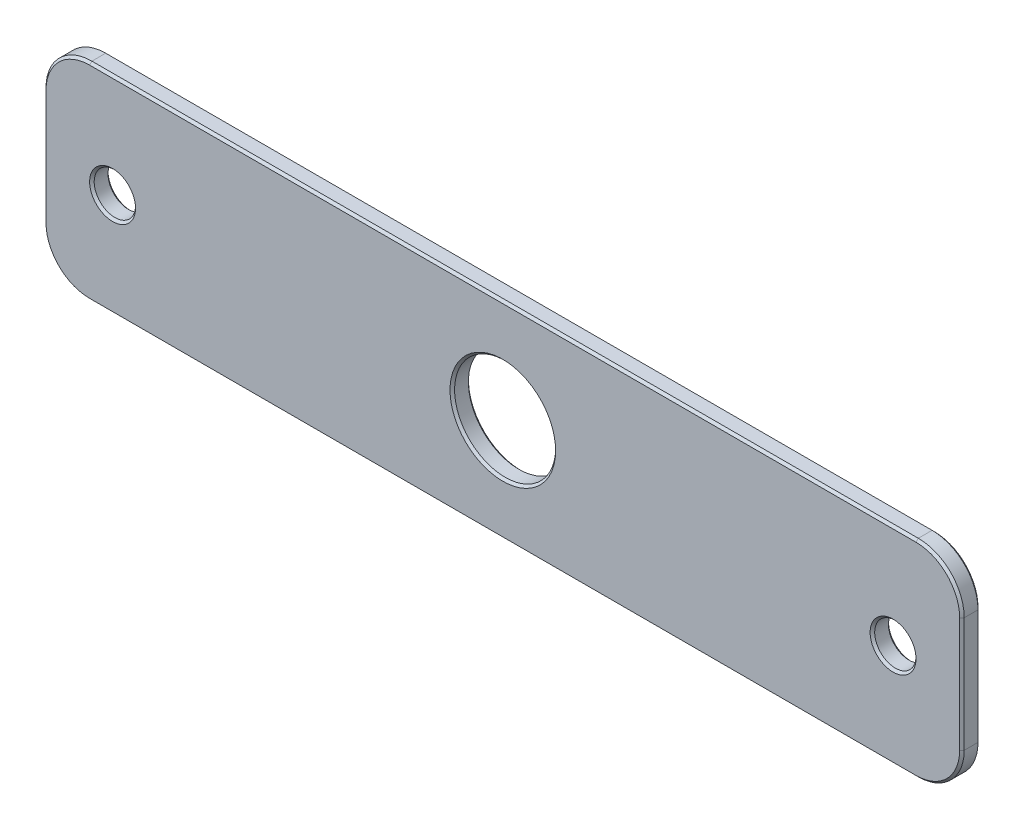
ISO-10303-21;
HEADER;
FILE_DESCRIPTION(('STEP AP214'),'2;1');
FILE_NAME('part.step','',(''),(''),'','','');
FILE_SCHEMA(('AUTOMOTIVE_DESIGN { 1 0 10303 214 1 1 1 1 }'));
ENDSEC;
DATA;
#1=APPLICATION_CONTEXT('core data for automotive mechanical design processes');
#2=APPLICATION_PROTOCOL_DEFINITION('international standard','automotive_design',2000,#1);
#3=PRODUCT_CONTEXT('',#1,'mechanical');
#4=PRODUCT('Part','Part','',(#3));
#5=PRODUCT_RELATED_PRODUCT_CATEGORY('part','',(#4));
#6=PRODUCT_DEFINITION_FORMATION('','',#4);
#7=PRODUCT_DEFINITION_CONTEXT('part definition',#1,'design');
#8=PRODUCT_DEFINITION('design','',#6,#7);
#9=PRODUCT_DEFINITION_SHAPE('','',#8);
#10=(LENGTH_UNIT() NAMED_UNIT(*) SI_UNIT(.MILLI.,.METRE.));
#11=(NAMED_UNIT(*) PLANE_ANGLE_UNIT() SI_UNIT($,.RADIAN.));
#12=(NAMED_UNIT(*) SI_UNIT($,.STERADIAN.) SOLID_ANGLE_UNIT());
#13=UNCERTAINTY_MEASURE_WITH_UNIT(LENGTH_MEASURE(1.E-05),#10,'distance_accuracy_value','');
#14=(GEOMETRIC_REPRESENTATION_CONTEXT(3) GLOBAL_UNCERTAINTY_ASSIGNED_CONTEXT((#13)) GLOBAL_UNIT_ASSIGNED_CONTEXT((#10,
#11,#12)) REPRESENTATION_CONTEXT('',''));
#15=CARTESIAN_POINT('',(0.,0.,0.));
#16=DIRECTION('',(0.,0.,1.));
#17=DIRECTION('',(1.,0.,0.));
#18=AXIS2_PLACEMENT_3D('',#15,#16,#17);
#19=CARTESIAN_POINT('',(-121.919003271456,81.5789473684211,4.));
#20=DIRECTION('',(1.,0.,0.));
#21=DIRECTION('',(0.,1.,0.));
#22=AXIS2_PLACEMENT_3D('',#19,#20,#21);
#23=PLANE('',#22);
#24=DIRECTION('',(0.,0.,-1.));
#25=VECTOR('',#24,1.);
#26=CARTESIAN_POINT('',(-121.919003271456,46.5789473684211,4.));
#27=LINE('',#26,#25);
#28=CARTESIAN_POINT('',(-121.919003271456,46.5789473684211,0.5));
#29=VERTEX_POINT('',#28);
#30=CARTESIAN_POINT('',(-121.919003271456,46.5789473684211,3.5));
#31=VERTEX_POINT('',#30);
#32=EDGE_CURVE('E179',#29,#31,#27,.F.);
#33=ORIENTED_EDGE('',*,*,#32,.T.);
#34=DIRECTION('',(0.,1.,0.));
#35=VECTOR('',#34,1.);
#36=CARTESIAN_POINT('',(-121.919003271456,71.5789473684211,3.49999999999997));
#37=LINE('',#36,#35);
#38=CARTESIAN_POINT('',(-121.919003271456,71.5789473684211,3.5));
#39=VERTEX_POINT('',#38);
#40=EDGE_CURVE('E304',#31,#39,#37,.T.);
#41=ORIENTED_EDGE('',*,*,#40,.T.);
#42=DIRECTION('',(0.,0.,-1.));
#43=VECTOR('',#42,1.);
#44=CARTESIAN_POINT('',(-121.919003271456,71.5789473684211,4.));
#45=LINE('',#44,#43);
#46=CARTESIAN_POINT('',(-121.919003271456,71.5789473684211,0.5));
#47=VERTEX_POINT('',#46);
#48=EDGE_CURVE('E380',#39,#47,#45,.T.);
#49=ORIENTED_EDGE('',*,*,#48,.T.);
#50=DIRECTION('',(0.,-1.,0.));
#51=VECTOR('',#50,1.);
#52=CARTESIAN_POINT('',(-121.919003271456,81.5789473684211,0.5));
#53=LINE('',#52,#51);
#54=EDGE_CURVE('E311',#47,#29,#53,.T.);
#55=ORIENTED_EDGE('',*,*,#54,.T.);
#56=EDGE_LOOP('',(#33,#41,#49,#55));
#57=FACE_BOUND('',#56,.T.);
#58=ADVANCED_FACE('F35',(#57),#23,.F.);
#59=CARTESIAN_POINT('',(-121.919003271456,36.5789473684211,4.));
#60=DIRECTION('',(0.,1.,0.));
#61=DIRECTION('',(0.,0.,1.));
#62=AXIS2_PLACEMENT_3D('',#59,#60,#61);
#63=PLANE('',#62);
#64=DIRECTION('',(0.,0.,-1.));
#65=VECTOR('',#64,1.);
#66=CARTESIAN_POINT('',(68.0809967285443,36.5789473684211,4.));
#67=LINE('',#66,#65);
#68=CARTESIAN_POINT('',(68.0809967285443,36.5789473684211,0.5));
#69=VERTEX_POINT('',#68);
#70=CARTESIAN_POINT('',(68.0809967285443,36.5789473684211,3.5));
#71=VERTEX_POINT('',#70);
#72=EDGE_CURVE('E355',#69,#71,#67,.F.);
#73=ORIENTED_EDGE('',*,*,#72,.T.);
#74=DIRECTION('',(-1.,0.,0.));
#75=VECTOR('',#74,1.);
#76=CARTESIAN_POINT('',(-111.919003271456,36.5789473684211,3.5));
#77=LINE('',#76,#75);
#78=CARTESIAN_POINT('',(-111.919003271456,36.5789473684211,3.5));
#79=VERTEX_POINT('',#78);
#80=EDGE_CURVE('E213',#71,#79,#77,.T.);
#81=ORIENTED_EDGE('',*,*,#80,.T.);
#82=DIRECTION('',(0.,0.,-1.));
#83=VECTOR('',#82,1.);
#84=CARTESIAN_POINT('',(-111.919003271456,36.5789473684211,4.));
#85=LINE('',#84,#83);
#86=CARTESIAN_POINT('',(-111.919003271456,36.5789473684211,0.5));
#87=VERTEX_POINT('',#86);
#88=EDGE_CURVE('E352',#79,#87,#85,.T.);
#89=ORIENTED_EDGE('',*,*,#88,.T.);
#90=DIRECTION('',(1.,0.,0.));
#91=VECTOR('',#90,1.);
#92=CARTESIAN_POINT('',(-121.919003271456,36.5789473684211,0.5));
#93=LINE('',#92,#91);
#94=EDGE_CURVE('E58',#87,#69,#93,.T.);
#95=ORIENTED_EDGE('',*,*,#94,.T.);
#96=EDGE_LOOP('',(#73,#81,#89,#95));
#97=FACE_BOUND('',#96,.T.);
#98=ADVANCED_FACE('F385',(#97),#63,.F.);
#99=CARTESIAN_POINT('',(78.0809967285443,81.5789473684211,4.));
#100=DIRECTION('',(-1.,0.,0.));
#101=DIRECTION('',(0.,-1.,0.));
#102=AXIS2_PLACEMENT_3D('',#99,#100,#101);
#103=PLANE('',#102);
#104=DIRECTION('',(0.,0.,-1.));
#105=VECTOR('',#104,1.);
#106=CARTESIAN_POINT('',(78.0809967285443,71.5789473684211,4.));
#107=LINE('',#106,#105);
#108=CARTESIAN_POINT('',(78.0809967285443,71.5789473684211,0.5));
#109=VERTEX_POINT('',#108);
#110=CARTESIAN_POINT('',(78.0809967285443,71.5789473684211,3.5));
#111=VERTEX_POINT('',#110);
#112=EDGE_CURVE('E348',#109,#111,#107,.F.);
#113=ORIENTED_EDGE('',*,*,#112,.T.);
#114=DIRECTION('',(0.,-1.,0.));
#115=VECTOR('',#114,1.);
#116=CARTESIAN_POINT('',(78.0809967285443,46.5789473684211,3.5));
#117=LINE('',#116,#115);
#118=CARTESIAN_POINT('',(78.0809967285443,46.5789473684211,3.5));
#119=VERTEX_POINT('',#118);
#120=EDGE_CURVE('E314',#111,#119,#117,.T.);
#121=ORIENTED_EDGE('',*,*,#120,.T.);
#122=DIRECTION('',(0.,0.,-1.));
#123=VECTOR('',#122,1.);
#124=CARTESIAN_POINT('',(78.0809967285443,46.5789473684211,4.));
#125=LINE('',#124,#123);
#126=CARTESIAN_POINT('',(78.0809967285443,46.5789473684211,0.5));
#127=VERTEX_POINT('',#126);
#128=EDGE_CURVE('E173',#119,#127,#125,.T.);
#129=ORIENTED_EDGE('',*,*,#128,.T.);
#130=DIRECTION('',(0.,1.,0.));
#131=VECTOR('',#130,1.);
#132=CARTESIAN_POINT('',(78.0809967285443,81.5789473684211,0.5));
#133=LINE('',#132,#131);
#134=EDGE_CURVE('E310',#127,#109,#133,.T.);
#135=ORIENTED_EDGE('',*,*,#134,.T.);
#136=EDGE_LOOP('',(#113,#121,#129,#135));
#137=FACE_BOUND('',#136,.T.);
#138=ADVANCED_FACE('F347',(#137),#103,.F.);
#139=CARTESIAN_POINT('',(-121.919003271456,81.5789473684211,4.));
#140=DIRECTION('',(0.,-1.,0.));
#141=DIRECTION('',(0.,0.,-1.));
#142=AXIS2_PLACEMENT_3D('',#139,#140,#141);
#143=PLANE('',#142);
#144=DIRECTION('',(0.,0.,-1.));
#145=VECTOR('',#144,1.);
#146=CARTESIAN_POINT('',(-111.919003271456,81.5789473684211,4.));
#147=LINE('',#146,#145);
#148=CARTESIAN_POINT('',(-111.919003271456,81.5789473684211,0.5));
#149=VERTEX_POINT('',#148);
#150=CARTESIAN_POINT('',(-111.919003271456,81.5789473684211,3.5));
#151=VERTEX_POINT('',#150);
#152=EDGE_CURVE('E377',#149,#151,#147,.F.);
#153=ORIENTED_EDGE('',*,*,#152,.T.);
#154=DIRECTION('',(1.,0.,0.));
#155=VECTOR('',#154,1.);
#156=CARTESIAN_POINT('',(68.0809967285443,81.5789473684211,3.5));
#157=LINE('',#156,#155);
#158=CARTESIAN_POINT('',(68.0809967285443,81.5789473684211,3.5));
#159=VERTEX_POINT('',#158);
#160=EDGE_CURVE('E316',#151,#159,#157,.T.);
#161=ORIENTED_EDGE('',*,*,#160,.T.);
#162=DIRECTION('',(0.,0.,-1.));
#163=VECTOR('',#162,1.);
#164=CARTESIAN_POINT('',(68.0809967285443,81.5789473684211,4.));
#165=LINE('',#164,#163);
#166=CARTESIAN_POINT('',(68.0809967285443,81.5789473684211,0.5));
#167=VERTEX_POINT('',#166);
#168=EDGE_CURVE('E375',#159,#167,#165,.T.);
#169=ORIENTED_EDGE('',*,*,#168,.T.);
#170=DIRECTION('',(-1.,0.,0.));
#171=VECTOR('',#170,1.);
#172=CARTESIAN_POINT('',(-121.919003271456,81.5789473684211,0.5));
#173=LINE('',#172,#171);
#174=EDGE_CURVE('E369',#167,#149,#173,.T.);
#175=ORIENTED_EDGE('',*,*,#174,.T.);
#176=EDGE_LOOP('',(#153,#161,#169,#175));
#177=FACE_BOUND('',#176,.T.);
#178=ADVANCED_FACE('F374',(#177),#143,.F.);
#179=CARTESIAN_POINT('',(0.,0.,4.));
#180=DIRECTION('',(0.,0.,1.));
#181=DIRECTION('',(1.,0.,0.));
#182=AXIS2_PLACEMENT_3D('',#179,#180,#181);
#183=PLANE('',#182);
#184=CARTESIAN_POINT('',(-106.919003271456,59.0789473684211,4.));
#185=DIRECTION('',(0.,0.,1.));
#186=DIRECTION('',(1.,0.,0.));
#187=AXIS2_PLACEMENT_3D('',#184,#185,#186);
#188=CIRCLE('',#187,5.);
#189=CARTESIAN_POINT('',(-101.919003271456,59.0789473684211,4.));
#190=VERTEX_POINT('',#189);
#191=EDGE_CURVE('E222',#190,#190,#188,.F.);
#192=ORIENTED_EDGE('',*,*,#191,.T.);
#193=EDGE_LOOP('',(#192));
#194=FACE_BOUND('',#193,.T.);
#195=CARTESIAN_POINT('',(-21.9190032714557,59.0789473684211,4.));
#196=DIRECTION('',(0.,0.,1.));
#197=DIRECTION('',(1.,0.,0.));
#198=AXIS2_PLACEMENT_3D('',#195,#196,#197);
#199=CIRCLE('',#198,11.5);
#200=CARTESIAN_POINT('',(-10.4190032714556,59.0789473684211,4.));
#201=VERTEX_POINT('',#200);
#202=EDGE_CURVE('E219',#201,#201,#199,.F.);
#203=ORIENTED_EDGE('',*,*,#202,.T.);
#204=EDGE_LOOP('',(#203));
#205=FACE_BOUND('',#204,.T.);
#206=CARTESIAN_POINT('',(63.0809967285443,59.0789473684211,4.));
#207=DIRECTION('',(0.,0.,1.));
#208=DIRECTION('',(1.,0.,0.));
#209=AXIS2_PLACEMENT_3D('',#206,#207,#208);
#210=CIRCLE('',#209,5.);
#211=CARTESIAN_POINT('',(68.0809967285443,59.0789473684211,4.));
#212=VERTEX_POINT('',#211);
#213=EDGE_CURVE('E216',#212,#212,#210,.F.);
#214=ORIENTED_EDGE('',*,*,#213,.T.);
#215=EDGE_LOOP('',(#214));
#216=FACE_BOUND('',#215,.T.);
#217=CARTESIAN_POINT('',(68.0809967285443,71.5789473684211,4.));
#218=DIRECTION('',(0.,0.,1.));
#219=DIRECTION('',(1.,0.,0.));
#220=AXIS2_PLACEMENT_3D('',#217,#218,#219);
#221=CIRCLE('',#220,9.49999999999999);
#222=CARTESIAN_POINT('',(77.5809967285443,71.5789473684211,4.));
#223=VERTEX_POINT('',#222);
#224=CARTESIAN_POINT('',(68.0809967285443,81.0789473684211,4.));
#225=VERTEX_POINT('',#224);
#226=EDGE_CURVE('E362',#223,#225,#221,.T.);
#227=ORIENTED_EDGE('',*,*,#226,.T.);
#228=DIRECTION('',(-1.,0.,0.));
#229=VECTOR('',#228,1.);
#230=CARTESIAN_POINT('',(-111.919003271456,81.0789473684211,4.));
#231=LINE('',#230,#229);
#232=CARTESIAN_POINT('',(-111.919003271456,81.0789473684211,4.));
#233=VERTEX_POINT('',#232);
#234=EDGE_CURVE('E366',#225,#233,#231,.T.);
#235=ORIENTED_EDGE('',*,*,#234,.T.);
#236=CARTESIAN_POINT('',(-111.919003271456,71.5789473684211,4.));
#237=DIRECTION('',(0.,0.,1.));
#238=DIRECTION('',(1.,0.,0.));
#239=AXIS2_PLACEMENT_3D('',#236,#237,#238);
#240=CIRCLE('',#239,9.49999999999999);
#241=CARTESIAN_POINT('',(-121.419003271456,71.5789473684211,4.));
#242=VERTEX_POINT('',#241);
#243=EDGE_CURVE('E364',#233,#242,#240,.T.);
#244=ORIENTED_EDGE('',*,*,#243,.T.);
#245=DIRECTION('',(0.,-1.,0.));
#246=VECTOR('',#245,1.);
#247=CARTESIAN_POINT('',(-121.419003271456,46.5789473684211,4.));
#248=LINE('',#247,#246);
#249=CARTESIAN_POINT('',(-121.419003271456,46.5789473684211,4.));
#250=VERTEX_POINT('',#249);
#251=EDGE_CURVE('E156',#242,#250,#248,.T.);
#252=ORIENTED_EDGE('',*,*,#251,.T.);
#253=CARTESIAN_POINT('',(-111.919003271456,46.5789473684211,4.));
#254=DIRECTION('',(0.,0.,1.));
#255=DIRECTION('',(1.,0.,0.));
#256=AXIS2_PLACEMENT_3D('',#253,#254,#255);
#257=CIRCLE('',#256,9.49999999999999);
#258=CARTESIAN_POINT('',(-111.919003271456,37.0789473684211,4.));
#259=VERTEX_POINT('',#258);
#260=EDGE_CURVE('E150',#250,#259,#257,.T.);
#261=ORIENTED_EDGE('',*,*,#260,.T.);
#262=DIRECTION('',(1.,0.,0.));
#263=VECTOR('',#262,1.);
#264=CARTESIAN_POINT('',(68.0809967285443,37.0789473684211,4.));
#265=LINE('',#264,#263);
#266=CARTESIAN_POINT('',(68.0809967285443,37.0789473684211,4.));
#267=VERTEX_POINT('',#266);
#268=EDGE_CURVE('E153',#259,#267,#265,.T.);
#269=ORIENTED_EDGE('',*,*,#268,.T.);
#270=CARTESIAN_POINT('',(68.0809967285443,46.5789473684211,4.));
#271=DIRECTION('',(0.,0.,1.));
#272=DIRECTION('',(1.,0.,0.));
#273=AXIS2_PLACEMENT_3D('',#270,#271,#272);
#274=CIRCLE('',#273,9.49999999999999);
#275=CARTESIAN_POINT('',(77.5809967285443,46.5789473684211,4.));
#276=VERTEX_POINT('',#275);
#277=EDGE_CURVE('E162',#267,#276,#274,.T.);
#278=ORIENTED_EDGE('',*,*,#277,.T.);
#279=DIRECTION('',(0.,1.,0.));
#280=VECTOR('',#279,1.);
#281=CARTESIAN_POINT('',(77.5809967285443,71.5789473684211,4.));
#282=LINE('',#281,#280);
#283=EDGE_CURVE('E161',#276,#223,#282,.T.);
#284=ORIENTED_EDGE('',*,*,#283,.T.);
#285=EDGE_LOOP('',(#227,#235,#244,#252,#261,#269,#278,#284));
#286=FACE_BOUND('',#285,.T.);
#287=ADVANCED_FACE('F152',(#194,#205,#216,#286),#183,.T.);
#288=CARTESIAN_POINT('',(0.,0.,0.));
#289=DIRECTION('',(0.,0.,1.));
#290=DIRECTION('',(1.,0.,0.));
#291=AXIS2_PLACEMENT_3D('',#288,#289,#290);
#292=PLANE('',#291);
#293=CARTESIAN_POINT('',(-106.919003271456,59.0789473684211,0.));
#294=DIRECTION('',(0.,0.,1.));
#295=DIRECTION('',(1.,0.,0.));
#296=AXIS2_PLACEMENT_3D('',#293,#294,#295);
#297=CIRCLE('',#296,4.99999999999998);
#298=CARTESIAN_POINT('',(-101.919003271456,59.0789473684211,0.));
#299=VERTEX_POINT('',#298);
#300=EDGE_CURVE('E231',#299,#299,#297,.T.);
#301=ORIENTED_EDGE('',*,*,#300,.T.);
#302=EDGE_LOOP('',(#301));
#303=FACE_BOUND('',#302,.T.);
#304=CARTESIAN_POINT('',(-21.9190032714557,59.0789473684211,0.));
#305=DIRECTION('',(0.,0.,1.));
#306=DIRECTION('',(1.,0.,0.));
#307=AXIS2_PLACEMENT_3D('',#304,#305,#306);
#308=CIRCLE('',#307,11.5);
#309=CARTESIAN_POINT('',(-10.4190032714557,59.0789473684211,0.));
#310=VERTEX_POINT('',#309);
#311=EDGE_CURVE('E228',#310,#310,#308,.T.);
#312=ORIENTED_EDGE('',*,*,#311,.T.);
#313=EDGE_LOOP('',(#312));
#314=FACE_BOUND('',#313,.T.);
#315=CARTESIAN_POINT('',(63.0809967285443,59.0789473684211,0.));
#316=DIRECTION('',(0.,0.,1.));
#317=DIRECTION('',(1.,0.,0.));
#318=AXIS2_PLACEMENT_3D('',#315,#316,#317);
#319=CIRCLE('',#318,4.99999999999998);
#320=CARTESIAN_POINT('',(68.0809967285443,59.0789473684211,0.));
#321=VERTEX_POINT('',#320);
#322=EDGE_CURVE('E225',#321,#321,#319,.T.);
#323=ORIENTED_EDGE('',*,*,#322,.T.);
#324=EDGE_LOOP('',(#323));
#325=FACE_BOUND('',#324,.T.);
#326=CARTESIAN_POINT('',(-111.919003271456,71.5789473684211,0.));
#327=DIRECTION('',(0.,0.,1.));
#328=DIRECTION('',(1.,0.,0.));
#329=AXIS2_PLACEMENT_3D('',#326,#327,#328);
#330=CIRCLE('',#329,9.49999999999999);
#331=CARTESIAN_POINT('',(-121.419003271456,71.5789473684211,0.));
#332=VERTEX_POINT('',#331);
#333=CARTESIAN_POINT('',(-111.919003271456,81.0789473684211,0.));
#334=VERTEX_POINT('',#333);
#335=EDGE_CURVE('E256',#332,#334,#330,.F.);
#336=ORIENTED_EDGE('',*,*,#335,.T.);
#337=DIRECTION('',(1.,0.,0.));
#338=VECTOR('',#337,1.);
#339=CARTESIAN_POINT('',(0.,81.0789473684211,0.));
#340=LINE('',#339,#338);
#341=CARTESIAN_POINT('',(68.0809967285443,81.0789473684211,0.));
#342=VERTEX_POINT('',#341);
#343=EDGE_CURVE('E259',#334,#342,#340,.T.);
#344=ORIENTED_EDGE('',*,*,#343,.T.);
#345=CARTESIAN_POINT('',(68.0809967285443,71.5789473684211,0.));
#346=DIRECTION('',(0.,0.,1.));
#347=DIRECTION('',(1.,0.,0.));
#348=AXIS2_PLACEMENT_3D('',#345,#346,#347);
#349=CIRCLE('',#348,9.49999999999999);
#350=CARTESIAN_POINT('',(77.5809967285443,71.5789473684211,0.));
#351=VERTEX_POINT('',#350);
#352=EDGE_CURVE('E265',#342,#351,#349,.F.);
#353=ORIENTED_EDGE('',*,*,#352,.T.);
#354=DIRECTION('',(0.,-1.,0.));
#355=VECTOR('',#354,1.);
#356=CARTESIAN_POINT('',(77.5809967285443,0.,0.));
#357=LINE('',#356,#355);
#358=CARTESIAN_POINT('',(77.5809967285443,46.5789473684211,0.));
#359=VERTEX_POINT('',#358);
#360=EDGE_CURVE('E328',#351,#359,#357,.T.);
#361=ORIENTED_EDGE('',*,*,#360,.T.);
#362=CARTESIAN_POINT('',(68.0809967285443,46.5789473684211,0.));
#363=DIRECTION('',(0.,0.,1.));
#364=DIRECTION('',(1.,0.,0.));
#365=AXIS2_PLACEMENT_3D('',#362,#363,#364);
#366=CIRCLE('',#365,9.5);
#367=CARTESIAN_POINT('',(68.0809967285443,37.0789473684211,0.));
#368=VERTEX_POINT('',#367);
#369=EDGE_CURVE('E323',#359,#368,#366,.F.);
#370=ORIENTED_EDGE('',*,*,#369,.T.);
#371=DIRECTION('',(-1.,0.,0.));
#372=VECTOR('',#371,1.);
#373=CARTESIAN_POINT('',(0.,37.0789473684211,0.));
#374=LINE('',#373,#372);
#375=CARTESIAN_POINT('',(-111.919003271456,37.0789473684211,0.));
#376=VERTEX_POINT('',#375);
#377=EDGE_CURVE('E321',#368,#376,#374,.T.);
#378=ORIENTED_EDGE('',*,*,#377,.T.);
#379=CARTESIAN_POINT('',(-111.919003271456,46.5789473684211,0.));
#380=DIRECTION('',(0.,0.,1.));
#381=DIRECTION('',(1.,0.,0.));
#382=AXIS2_PLACEMENT_3D('',#379,#380,#381);
#383=CIRCLE('',#382,9.49999999999999);
#384=CARTESIAN_POINT('',(-121.419003271456,46.5789473684211,0.));
#385=VERTEX_POINT('',#384);
#386=EDGE_CURVE('E325',#376,#385,#383,.F.);
#387=ORIENTED_EDGE('',*,*,#386,.T.);
#388=DIRECTION('',(0.,1.,0.));
#389=VECTOR('',#388,1.);
#390=CARTESIAN_POINT('',(-121.419003271456,0.,0.));
#391=LINE('',#390,#389);
#392=EDGE_CURVE('E262',#385,#332,#391,.T.);
#393=ORIENTED_EDGE('',*,*,#392,.T.);
#394=EDGE_LOOP('',(#336,#344,#353,#361,#370,#378,#387,#393));
#395=FACE_BOUND('',#394,.T.);
#396=ADVANCED_FACE('F249',(#303,#314,#325,#395),#292,.F.);
#397=CARTESIAN_POINT('',(-111.919003271456,71.5789473684211,4.));
#398=DIRECTION('',(0.,0.,-1.));
#399=DIRECTION('',(-1.,0.,0.));
#400=AXIS2_PLACEMENT_3D('',#397,#398,#399);
#401=CYLINDRICAL_SURFACE('',#400,10.);
#402=ORIENTED_EDGE('',*,*,#48,.F.);
#403=CARTESIAN_POINT('',(-111.919003271456,71.5789473684211,3.5));
#404=DIRECTION('',(0.,0.,1.));
#405=DIRECTION('',(1.,0.,0.));
#406=AXIS2_PLACEMENT_3D('',#403,#404,#405);
#407=CIRCLE('',#406,10.);
#408=EDGE_CURVE('E275',#39,#151,#407,.F.);
#409=ORIENTED_EDGE('',*,*,#408,.T.);
#410=ORIENTED_EDGE('',*,*,#152,.F.);
#411=CARTESIAN_POINT('',(-111.919003271456,71.5789473684211,0.5));
#412=DIRECTION('',(0.,0.,1.));
#413=DIRECTION('',(1.,0.,0.));
#414=AXIS2_PLACEMENT_3D('',#411,#412,#413);
#415=CIRCLE('',#414,10.);
#416=EDGE_CURVE('E269',#149,#47,#415,.T.);
#417=ORIENTED_EDGE('',*,*,#416,.T.);
#418=EDGE_LOOP('',(#402,#409,#410,#417));
#419=FACE_BOUND('',#418,.T.);
#420=ADVANCED_FACE('F252',(#419),#401,.T.);
#421=CARTESIAN_POINT('',(-111.919003271456,46.5789473684211,4.));
#422=DIRECTION('',(0.,0.,-1.));
#423=DIRECTION('',(-1.,0.,0.));
#424=AXIS2_PLACEMENT_3D('',#421,#422,#423);
#425=CYLINDRICAL_SURFACE('',#424,10.);
#426=ORIENTED_EDGE('',*,*,#88,.F.);
#427=CARTESIAN_POINT('',(-111.919003271456,46.5789473684211,3.5));
#428=DIRECTION('',(0.,0.,1.));
#429=DIRECTION('',(1.,0.,0.));
#430=AXIS2_PLACEMENT_3D('',#427,#428,#429);
#431=CIRCLE('',#430,10.);
#432=EDGE_CURVE('E176',#79,#31,#431,.F.);
#433=ORIENTED_EDGE('',*,*,#432,.T.);
#434=ORIENTED_EDGE('',*,*,#32,.F.);
#435=CARTESIAN_POINT('',(-111.919003271456,46.5789473684211,0.5));
#436=DIRECTION('',(0.,0.,1.));
#437=DIRECTION('',(1.,0.,0.));
#438=AXIS2_PLACEMENT_3D('',#435,#436,#437);
#439=CIRCLE('',#438,10.);
#440=EDGE_CURVE('E284',#29,#87,#439,.T.);
#441=ORIENTED_EDGE('',*,*,#440,.T.);
#442=EDGE_LOOP('',(#426,#433,#434,#441));
#443=FACE_BOUND('',#442,.T.);
#444=ADVANCED_FACE('F416',(#443),#425,.T.);
#445=CARTESIAN_POINT('',(68.0809967285443,46.5789473684211,4.));
#446=DIRECTION('',(0.,0.,-1.));
#447=DIRECTION('',(-1.,0.,0.));
#448=AXIS2_PLACEMENT_3D('',#445,#446,#447);
#449=CYLINDRICAL_SURFACE('',#448,10.);
#450=ORIENTED_EDGE('',*,*,#128,.F.);
#451=CARTESIAN_POINT('',(68.0809967285443,46.5789473684211,3.5));
#452=DIRECTION('',(0.,0.,1.));
#453=DIRECTION('',(1.,0.,0.));
#454=AXIS2_PLACEMENT_3D('',#451,#452,#453);
#455=CIRCLE('',#454,10.);
#456=EDGE_CURVE('E51',#119,#71,#455,.F.);
#457=ORIENTED_EDGE('',*,*,#456,.T.);
#458=ORIENTED_EDGE('',*,*,#72,.F.);
#459=CARTESIAN_POINT('',(68.0809967285443,46.5789473684211,0.5));
#460=DIRECTION('',(0.,0.,1.));
#461=DIRECTION('',(1.,0.,0.));
#462=AXIS2_PLACEMENT_3D('',#459,#460,#461);
#463=CIRCLE('',#462,10.);
#464=EDGE_CURVE('E287',#69,#127,#463,.T.);
#465=ORIENTED_EDGE('',*,*,#464,.T.);
#466=EDGE_LOOP('',(#450,#457,#458,#465));
#467=FACE_BOUND('',#466,.T.);
#468=ADVANCED_FACE('F418',(#467),#449,.T.);
#469=CARTESIAN_POINT('',(68.0809967285443,71.5789473684211,4.));
#470=DIRECTION('',(0.,0.,-1.));
#471=DIRECTION('',(-1.,0.,0.));
#472=AXIS2_PLACEMENT_3D('',#469,#470,#471);
#473=CYLINDRICAL_SURFACE('',#472,10.);
#474=ORIENTED_EDGE('',*,*,#168,.F.);
#475=CARTESIAN_POINT('',(68.0809967285443,71.5789473684211,3.5));
#476=DIRECTION('',(0.,0.,1.));
#477=DIRECTION('',(1.,0.,0.));
#478=AXIS2_PLACEMENT_3D('',#475,#476,#477);
#479=CIRCLE('',#478,10.);
#480=EDGE_CURVE('E282',#159,#111,#479,.F.);
#481=ORIENTED_EDGE('',*,*,#480,.T.);
#482=ORIENTED_EDGE('',*,*,#112,.F.);
#483=CARTESIAN_POINT('',(68.0809967285443,71.5789473684211,0.5));
#484=DIRECTION('',(0.,0.,1.));
#485=DIRECTION('',(1.,0.,0.));
#486=AXIS2_PLACEMENT_3D('',#483,#484,#485);
#487=CIRCLE('',#486,10.);
#488=EDGE_CURVE('E280',#109,#167,#487,.T.);
#489=ORIENTED_EDGE('',*,*,#488,.T.);
#490=EDGE_LOOP('',(#474,#481,#482,#489));
#491=FACE_BOUND('',#490,.T.);
#492=ADVANCED_FACE('F350',(#491),#473,.T.);
#493=CARTESIAN_POINT('',(63.0809967285443,59.0789473684211,4.));
#494=DIRECTION('',(0.,0.,1.));
#495=DIRECTION('',(1.,0.,0.));
#496=AXIS2_PLACEMENT_3D('',#493,#494,#495);
#497=CYLINDRICAL_SURFACE('',#496,4.5);
#498=CARTESIAN_POINT('',(63.0809967285443,59.0789473684211,3.50000000000001));
#499=DIRECTION('',(0.,0.,1.));
#500=DIRECTION('',(1.,0.,0.));
#501=AXIS2_PLACEMENT_3D('',#498,#499,#500);
#502=CIRCLE('',#501,4.5);
#503=CARTESIAN_POINT('',(67.5809967285443,59.0789473684211,3.50000000000001));
#504=VERTEX_POINT('',#503);
#505=EDGE_CURVE('E11',#504,#504,#502,.T.);
#506=ORIENTED_EDGE('',*,*,#505,.T.);
#507=EDGE_LOOP('',(#506));
#508=FACE_BOUND('',#507,.T.);
#509=CARTESIAN_POINT('',(63.0809967285443,59.0789473684211,0.499999999999988));
#510=DIRECTION('',(0.,0.,1.));
#511=DIRECTION('',(1.,0.,0.));
#512=AXIS2_PLACEMENT_3D('',#509,#510,#511);
#513=CIRCLE('',#512,4.5);
#514=CARTESIAN_POINT('',(67.5809967285443,59.0789473684211,0.499999999999988));
#515=VERTEX_POINT('',#514);
#516=EDGE_CURVE('E44',#515,#515,#513,.F.);
#517=ORIENTED_EDGE('',*,*,#516,.T.);
#518=EDGE_LOOP('',(#517));
#519=FACE_BOUND('',#518,.T.);
#520=ADVANCED_FACE('F242',(#508,#519),#497,.F.);
#521=CARTESIAN_POINT('',(-106.919003271456,59.0789473684211,4.));
#522=DIRECTION('',(0.,0.,1.));
#523=DIRECTION('',(1.,0.,0.));
#524=AXIS2_PLACEMENT_3D('',#521,#522,#523);
#525=CYLINDRICAL_SURFACE('',#524,4.5);
#526=CARTESIAN_POINT('',(-106.919003271456,59.0789473684211,3.50000000000001));
#527=DIRECTION('',(0.,0.,1.));
#528=DIRECTION('',(1.,0.,0.));
#529=AXIS2_PLACEMENT_3D('',#526,#527,#528);
#530=CIRCLE('',#529,4.5);
#531=CARTESIAN_POINT('',(-102.419003271456,59.0789473684211,3.50000000000001));
#532=VERTEX_POINT('',#531);
#533=EDGE_CURVE('E212',#532,#532,#530,.T.);
#534=ORIENTED_EDGE('',*,*,#533,.T.);
#535=EDGE_LOOP('',(#534));
#536=FACE_BOUND('',#535,.T.);
#537=CARTESIAN_POINT('',(-106.919003271456,59.0789473684211,0.499999999999988));
#538=DIRECTION('',(0.,0.,1.));
#539=DIRECTION('',(1.,0.,0.));
#540=AXIS2_PLACEMENT_3D('',#537,#538,#539);
#541=CIRCLE('',#540,4.5);
#542=CARTESIAN_POINT('',(-102.419003271456,59.0789473684211,0.499999999999988));
#543=VERTEX_POINT('',#542);
#544=EDGE_CURVE('E209',#543,#543,#541,.F.);
#545=ORIENTED_EDGE('',*,*,#544,.T.);
#546=EDGE_LOOP('',(#545));
#547=FACE_BOUND('',#546,.T.);
#548=ADVANCED_FACE('F442',(#536,#547),#525,.F.);
#549=CARTESIAN_POINT('',(-21.9190032714557,59.0789473684211,4.));
#550=DIRECTION('',(0.,0.,1.));
#551=DIRECTION('',(1.,0.,0.));
#552=AXIS2_PLACEMENT_3D('',#549,#550,#551);
#553=CYLINDRICAL_SURFACE('',#552,11.);
#554=CARTESIAN_POINT('',(-21.9190032714557,59.0789473684211,3.49999999999998));
#555=DIRECTION('',(0.,0.,1.));
#556=DIRECTION('',(1.,0.,0.));
#557=AXIS2_PLACEMENT_3D('',#554,#555,#556);
#558=CIRCLE('',#557,11.);
#559=CARTESIAN_POINT('',(-10.9190032714557,59.0789473684211,3.49999999999998));
#560=VERTEX_POINT('',#559);
#561=EDGE_CURVE('E237',#560,#560,#558,.T.);
#562=ORIENTED_EDGE('',*,*,#561,.T.);
#563=EDGE_LOOP('',(#562));
#564=FACE_BOUND('',#563,.T.);
#565=CARTESIAN_POINT('',(-21.9190032714557,59.0789473684211,0.499999999999966));
#566=DIRECTION('',(0.,0.,1.));
#567=DIRECTION('',(1.,0.,0.));
#568=AXIS2_PLACEMENT_3D('',#565,#566,#567);
#569=CIRCLE('',#568,11.);
#570=CARTESIAN_POINT('',(-10.9190032714557,59.0789473684211,0.499999999999966));
#571=VERTEX_POINT('',#570);
#572=EDGE_CURVE('E234',#571,#571,#569,.F.);
#573=ORIENTED_EDGE('',*,*,#572,.T.);
#574=EDGE_LOOP('',(#573));
#575=FACE_BOUND('',#574,.T.);
#576=ADVANCED_FACE('F446',(#564,#575),#553,.F.);
#577=CARTESIAN_POINT('',(0.,37.0789473684211,4.));
#578=DIRECTION('',(0.,-0.707106781186547,0.707106781186547));
#579=DIRECTION('',(-1.,0.,0.));
#580=AXIS2_PLACEMENT_3D('',#577,#578,#579);
#581=PLANE('',#580);
#582=DIRECTION('',(0.,0.707106781186547,0.707106781186547));
#583=VECTOR('',#582,1.);
#584=CARTESIAN_POINT('',(-111.919003271456,36.5789473684211,3.5));
#585=LINE('',#584,#583);
#586=EDGE_CURVE('E168',#79,#259,#585,.T.);
#587=ORIENTED_EDGE('',*,*,#586,.F.);
#588=ORIENTED_EDGE('',*,*,#80,.F.);
#589=DIRECTION('',(0.,-0.707106781186547,-0.707106781186547));
#590=VECTOR('',#589,1.);
#591=CARTESIAN_POINT('',(68.0809967285443,37.0789473684211,4.));
#592=LINE('',#591,#590);
#593=EDGE_CURVE('E171',#267,#71,#592,.T.);
#594=ORIENTED_EDGE('',*,*,#593,.F.);
#595=ORIENTED_EDGE('',*,*,#268,.F.);
#596=EDGE_LOOP('',(#587,#588,#594,#595));
#597=FACE_BOUND('',#596,.T.);
#598=ADVANCED_FACE('F166',(#597),#581,.T.);
#599=CARTESIAN_POINT('',(68.0809967285443,46.5789473684211,4.));
#600=DIRECTION('',(0.,0.,-1.));
#601=DIRECTION('',(-1.,0.,0.));
#602=AXIS2_PLACEMENT_3D('',#599,#600,#601);
#603=CONICAL_SURFACE('',#602,9.5,0.785398163397447);
#604=ORIENTED_EDGE('',*,*,#593,.T.);
#605=ORIENTED_EDGE('',*,*,#456,.F.);
#606=DIRECTION('',(0.707106781186547,0.,-0.707106781186547));
#607=VECTOR('',#606,1.);
#608=CARTESIAN_POINT('',(77.5809967285443,46.5789473684211,4.));
#609=LINE('',#608,#607);
#610=EDGE_CURVE('E177',#276,#119,#609,.T.);
#611=ORIENTED_EDGE('',*,*,#610,.F.);
#612=ORIENTED_EDGE('',*,*,#277,.F.);
#613=EDGE_LOOP('',(#604,#605,#611,#612));
#614=FACE_BOUND('',#613,.T.);
#615=ADVANCED_FACE('F389',(#614),#603,.T.);
#616=CARTESIAN_POINT('',(-111.919003271456,46.5789473684211,4.));
#617=DIRECTION('',(0.,0.,-1.));
#618=DIRECTION('',(-1.,0.,0.));
#619=AXIS2_PLACEMENT_3D('',#616,#617,#618);
#620=CONICAL_SURFACE('',#619,9.49999999999999,0.785398163397454);
#621=ORIENTED_EDGE('',*,*,#586,.T.);
#622=ORIENTED_EDGE('',*,*,#260,.F.);
#623=DIRECTION('',(0.707106781186547,0.,0.707106781186547));
#624=VECTOR('',#623,1.);
#625=CARTESIAN_POINT('',(-121.919003271456,46.5789473684211,3.5));
#626=LINE('',#625,#624);
#627=EDGE_CURVE('E182',#31,#250,#626,.T.);
#628=ORIENTED_EDGE('',*,*,#627,.F.);
#629=ORIENTED_EDGE('',*,*,#432,.F.);
#630=EDGE_LOOP('',(#621,#622,#628,#629));
#631=FACE_BOUND('',#630,.T.);
#632=ADVANCED_FACE('F175',(#631),#620,.T.);
#633=CARTESIAN_POINT('',(77.5809967285443,0.,4.));
#634=DIRECTION('',(0.707106781186549,0.,0.707106781186546));
#635=DIRECTION('',(0.,-1.,0.));
#636=AXIS2_PLACEMENT_3D('',#633,#634,#635);
#637=PLANE('',#636);
#638=ORIENTED_EDGE('',*,*,#610,.T.);
#639=ORIENTED_EDGE('',*,*,#120,.F.);
#640=DIRECTION('',(0.707106781186547,0.,-0.707106781186547));
#641=VECTOR('',#640,1.);
#642=CARTESIAN_POINT('',(77.5809967285443,71.5789473684211,4.));
#643=LINE('',#642,#641);
#644=EDGE_CURVE('E298',#223,#111,#643,.T.);
#645=ORIENTED_EDGE('',*,*,#644,.F.);
#646=ORIENTED_EDGE('',*,*,#283,.F.);
#647=EDGE_LOOP('',(#638,#639,#645,#646));
#648=FACE_BOUND('',#647,.T.);
#649=ADVANCED_FACE('F396',(#648),#637,.T.);
#650=CARTESIAN_POINT('',(-121.419003271456,0.,4.));
#651=DIRECTION('',(-0.707106781186546,0.,0.707106781186549));
#652=DIRECTION('',(0.,1.,0.));
#653=AXIS2_PLACEMENT_3D('',#650,#651,#652);
#654=PLANE('',#653);
#655=ORIENTED_EDGE('',*,*,#627,.T.);
#656=ORIENTED_EDGE('',*,*,#251,.F.);
#657=DIRECTION('',(0.707106781186548,0.,0.707106781186548));
#658=VECTOR('',#657,1.);
#659=CARTESIAN_POINT('',(-121.919003271456,71.5789473684211,3.49999999999997));
#660=LINE('',#659,#658);
#661=EDGE_CURVE('E295',#39,#242,#660,.T.);
#662=ORIENTED_EDGE('',*,*,#661,.F.);
#663=ORIENTED_EDGE('',*,*,#40,.F.);
#664=EDGE_LOOP('',(#655,#656,#662,#663));
#665=FACE_BOUND('',#664,.T.);
#666=ADVANCED_FACE('F302',(#665),#654,.T.);
#667=CARTESIAN_POINT('',(68.0809967285443,71.5789473684211,4.));
#668=DIRECTION('',(0.,0.,-1.));
#669=DIRECTION('',(-1.,0.,0.));
#670=AXIS2_PLACEMENT_3D('',#667,#668,#669);
#671=CONICAL_SURFACE('',#670,9.49999999999999,0.785398163397454);
#672=ORIENTED_EDGE('',*,*,#644,.T.);
#673=ORIENTED_EDGE('',*,*,#480,.F.);
#674=DIRECTION('',(0.,0.707106781186547,-0.707106781186547));
#675=VECTOR('',#674,1.);
#676=CARTESIAN_POINT('',(68.0809967285443,81.0789473684211,4.));
#677=LINE('',#676,#675);
#678=EDGE_CURVE('E293',#225,#159,#677,.T.);
#679=ORIENTED_EDGE('',*,*,#678,.F.);
#680=ORIENTED_EDGE('',*,*,#226,.F.);
#681=EDGE_LOOP('',(#672,#673,#679,#680));
#682=FACE_BOUND('',#681,.T.);
#683=ADVANCED_FACE('F398',(#682),#671,.T.);
#684=CARTESIAN_POINT('',(-111.919003271456,71.5789473684211,4.));
#685=DIRECTION('',(0.,0.,-1.));
#686=DIRECTION('',(-1.,0.,0.));
#687=AXIS2_PLACEMENT_3D('',#684,#685,#686);
#688=CONICAL_SURFACE('',#687,9.49999999999999,0.785398163397454);
#689=ORIENTED_EDGE('',*,*,#661,.T.);
#690=ORIENTED_EDGE('',*,*,#243,.F.);
#691=DIRECTION('',(0.,-0.707106781186547,0.707106781186547));
#692=VECTOR('',#691,1.);
#693=CARTESIAN_POINT('',(-111.919003271456,81.5789473684211,3.5));
#694=LINE('',#693,#692);
#695=EDGE_CURVE('E208',#151,#233,#694,.T.);
#696=ORIENTED_EDGE('',*,*,#695,.F.);
#697=ORIENTED_EDGE('',*,*,#408,.F.);
#698=EDGE_LOOP('',(#689,#690,#696,#697));
#699=FACE_BOUND('',#698,.T.);
#700=ADVANCED_FACE('F403',(#699),#688,.T.);
#701=CARTESIAN_POINT('',(0.,81.0789473684211,4.));
#702=DIRECTION('',(0.,0.707106781186547,0.707106781186547));
#703=DIRECTION('',(1.,0.,0.));
#704=AXIS2_PLACEMENT_3D('',#701,#702,#703);
#705=PLANE('',#704);
#706=ORIENTED_EDGE('',*,*,#678,.T.);
#707=ORIENTED_EDGE('',*,*,#160,.F.);
#708=ORIENTED_EDGE('',*,*,#695,.T.);
#709=ORIENTED_EDGE('',*,*,#234,.F.);
#710=EDGE_LOOP('',(#706,#707,#708,#709));
#711=FACE_BOUND('',#710,.T.);
#712=ADVANCED_FACE('F400',(#711),#705,.T.);
#713=CARTESIAN_POINT('',(-121.919003271456,81.5789473684211,0.5));
#714=DIRECTION('',(0.707106781186546,0.,0.707106781186549));
#715=DIRECTION('',(0.,-1.,0.));
#716=AXIS2_PLACEMENT_3D('',#713,#714,#715);
#717=PLANE('',#716);
#718=DIRECTION('',(-0.707106781186547,0.,0.707106781186547));
#719=VECTOR('',#718,1.);
#720=CARTESIAN_POINT('',(-121.419003271456,71.5789473684211,0.));
#721=LINE('',#720,#719);
#722=EDGE_CURVE('E202',#332,#47,#721,.T.);
#723=ORIENTED_EDGE('',*,*,#722,.F.);
#724=ORIENTED_EDGE('',*,*,#392,.F.);
#725=DIRECTION('',(0.707106781186547,0.,-0.707106781186547));
#726=VECTOR('',#725,1.);
#727=CARTESIAN_POINT('',(-121.919003271456,46.5789473684211,0.5));
#728=LINE('',#727,#726);
#729=EDGE_CURVE('E205',#29,#385,#728,.T.);
#730=ORIENTED_EDGE('',*,*,#729,.F.);
#731=ORIENTED_EDGE('',*,*,#54,.F.);
#732=EDGE_LOOP('',(#723,#724,#730,#731));
#733=FACE_BOUND('',#732,.T.);
#734=ADVANCED_FACE('F409',(#733),#717,.F.);
#735=CARTESIAN_POINT('',(-111.919003271456,46.5789473684211,0.));
#736=DIRECTION('',(0.,0.,1.));
#737=DIRECTION('',(1.,0.,0.));
#738=AXIS2_PLACEMENT_3D('',#735,#736,#737);
#739=CONICAL_SURFACE('',#738,9.49999999999999,0.785398163397454);
#740=ORIENTED_EDGE('',*,*,#729,.T.);
#741=ORIENTED_EDGE('',*,*,#386,.F.);
#742=DIRECTION('',(0.,0.707106781186552,-0.707106781186542));
#743=VECTOR('',#742,1.);
#744=CARTESIAN_POINT('',(-111.919003271456,36.5789473684211,0.5));
#745=LINE('',#744,#743);
#746=EDGE_CURVE('E199',#87,#376,#745,.T.);
#747=ORIENTED_EDGE('',*,*,#746,.F.);
#748=ORIENTED_EDGE('',*,*,#440,.F.);
#749=EDGE_LOOP('',(#740,#741,#747,#748));
#750=FACE_BOUND('',#749,.T.);
#751=ADVANCED_FACE('F414',(#750),#739,.T.);
#752=CARTESIAN_POINT('',(-111.919003271456,71.5789473684211,0.));
#753=DIRECTION('',(0.,0.,1.));
#754=DIRECTION('',(1.,0.,0.));
#755=AXIS2_PLACEMENT_3D('',#752,#753,#754);
#756=CONICAL_SURFACE('',#755,9.49999999999999,0.785398163397454);
#757=ORIENTED_EDGE('',*,*,#722,.T.);
#758=ORIENTED_EDGE('',*,*,#416,.F.);
#759=DIRECTION('',(0.,0.707106781186547,0.707106781186547));
#760=VECTOR('',#759,1.);
#761=CARTESIAN_POINT('',(-111.919003271456,81.0789473684211,0.));
#762=LINE('',#761,#760);
#763=EDGE_CURVE('E196',#334,#149,#762,.T.);
#764=ORIENTED_EDGE('',*,*,#763,.F.);
#765=ORIENTED_EDGE('',*,*,#335,.F.);
#766=EDGE_LOOP('',(#757,#758,#764,#765));
#767=FACE_BOUND('',#766,.T.);
#768=ADVANCED_FACE('F268',(#767),#756,.T.);
#769=CARTESIAN_POINT('',(-121.919003271456,36.5789473684211,0.5));
#770=DIRECTION('',(0.,0.707106781186547,0.707106781186547));
#771=DIRECTION('',(1.,0.,0.));
#772=AXIS2_PLACEMENT_3D('',#769,#770,#771);
#773=PLANE('',#772);
#774=ORIENTED_EDGE('',*,*,#746,.T.);
#775=ORIENTED_EDGE('',*,*,#377,.F.);
#776=DIRECTION('',(0.,0.707106781186547,-0.707106781186547));
#777=VECTOR('',#776,1.);
#778=CARTESIAN_POINT('',(68.0809967285443,36.5789473684211,0.5));
#779=LINE('',#778,#777);
#780=EDGE_CURVE('E193',#69,#368,#779,.T.);
#781=ORIENTED_EDGE('',*,*,#780,.F.);
#782=ORIENTED_EDGE('',*,*,#94,.F.);
#783=EDGE_LOOP('',(#774,#775,#781,#782));
#784=FACE_BOUND('',#783,.T.);
#785=ADVANCED_FACE('F516',(#784),#773,.F.);
#786=CARTESIAN_POINT('',(-121.919003271456,81.5789473684211,0.5));
#787=DIRECTION('',(0.,-0.707106781186547,0.707106781186547));
#788=DIRECTION('',(-1.,0.,0.));
#789=AXIS2_PLACEMENT_3D('',#786,#787,#788);
#790=PLANE('',#789);
#791=ORIENTED_EDGE('',*,*,#763,.T.);
#792=ORIENTED_EDGE('',*,*,#174,.F.);
#793=DIRECTION('',(0.,0.707106781186547,0.707106781186547));
#794=VECTOR('',#793,1.);
#795=CARTESIAN_POINT('',(68.0809967285443,81.0789473684211,0.));
#796=LINE('',#795,#794);
#797=EDGE_CURVE('E190',#342,#167,#796,.T.);
#798=ORIENTED_EDGE('',*,*,#797,.F.);
#799=ORIENTED_EDGE('',*,*,#343,.F.);
#800=EDGE_LOOP('',(#791,#792,#798,#799));
#801=FACE_BOUND('',#800,.T.);
#802=ADVANCED_FACE('F272',(#801),#790,.F.);
#803=CARTESIAN_POINT('',(68.0809967285443,46.5789473684211,0.));
#804=DIRECTION('',(0.,0.,1.));
#805=DIRECTION('',(1.,0.,0.));
#806=AXIS2_PLACEMENT_3D('',#803,#804,#805);
#807=CONICAL_SURFACE('',#806,9.5,0.785398163397447);
#808=ORIENTED_EDGE('',*,*,#780,.T.);
#809=ORIENTED_EDGE('',*,*,#369,.F.);
#810=DIRECTION('',(-0.707106781186548,0.,-0.707106781186547));
#811=VECTOR('',#810,1.);
#812=CARTESIAN_POINT('',(78.0809967285443,46.5789473684211,0.5));
#813=LINE('',#812,#811);
#814=EDGE_CURVE('E188',#127,#359,#813,.T.);
#815=ORIENTED_EDGE('',*,*,#814,.F.);
#816=ORIENTED_EDGE('',*,*,#464,.F.);
#817=EDGE_LOOP('',(#808,#809,#815,#816));
#818=FACE_BOUND('',#817,.T.);
#819=ADVANCED_FACE('F528',(#818),#807,.T.);
#820=CARTESIAN_POINT('',(68.0809967285443,71.5789473684211,0.));
#821=DIRECTION('',(0.,0.,1.));
#822=DIRECTION('',(1.,0.,0.));
#823=AXIS2_PLACEMENT_3D('',#820,#821,#822);
#824=CONICAL_SURFACE('',#823,9.49999999999999,0.785398163397454);
#825=ORIENTED_EDGE('',*,*,#797,.T.);
#826=ORIENTED_EDGE('',*,*,#488,.F.);
#827=DIRECTION('',(0.707106781186547,0.,0.707106781186547));
#828=VECTOR('',#827,1.);
#829=CARTESIAN_POINT('',(77.5809967285443,71.5789473684211,0.));
#830=LINE('',#829,#828);
#831=EDGE_CURVE('E186',#351,#109,#830,.T.);
#832=ORIENTED_EDGE('',*,*,#831,.F.);
#833=ORIENTED_EDGE('',*,*,#352,.F.);
#834=EDGE_LOOP('',(#825,#826,#832,#833));
#835=FACE_BOUND('',#834,.T.);
#836=ADVANCED_FACE('F339',(#835),#824,.T.);
#837=CARTESIAN_POINT('',(78.0809967285443,81.5789473684211,0.5));
#838=DIRECTION('',(-0.707106781186549,0.,0.707106781186546));
#839=DIRECTION('',(0.,1.,0.));
#840=AXIS2_PLACEMENT_3D('',#837,#838,#839);
#841=PLANE('',#840);
#842=ORIENTED_EDGE('',*,*,#814,.T.);
#843=ORIENTED_EDGE('',*,*,#360,.F.);
#844=ORIENTED_EDGE('',*,*,#831,.T.);
#845=ORIENTED_EDGE('',*,*,#134,.F.);
#846=EDGE_LOOP('',(#842,#843,#844,#845));
#847=FACE_BOUND('',#846,.T.);
#848=ADVANCED_FACE('F334',(#847),#841,.F.);
#849=CARTESIAN_POINT('',(-106.919003271456,59.0789473684211,3.50000000000001));
#850=DIRECTION('',(0.,0.,1.));
#851=DIRECTION('',(1.,0.,0.));
#852=AXIS2_PLACEMENT_3D('',#849,#850,#851);
#853=CONICAL_SURFACE('',#852,4.5,0.78539816339746);
#854=ORIENTED_EDGE('',*,*,#191,.F.);
#855=EDGE_LOOP('',(#854));
#856=FACE_BOUND('',#855,.T.);
#857=ORIENTED_EDGE('',*,*,#533,.F.);
#858=EDGE_LOOP('',(#857));
#859=FACE_BOUND('',#858,.T.);
#860=ADVANCED_FACE('F491',(#856,#859),#853,.F.);
#861=CARTESIAN_POINT('',(-106.919003271456,59.0789473684211,0.));
#862=DIRECTION('',(0.,0.,-1.));
#863=DIRECTION('',(-1.,0.,0.));
#864=AXIS2_PLACEMENT_3D('',#861,#862,#863);
#865=CONICAL_SURFACE('',#864,4.99999999999998,0.785398163397433);
#866=ORIENTED_EDGE('',*,*,#544,.F.);
#867=EDGE_LOOP('',(#866));
#868=FACE_BOUND('',#867,.T.);
#869=ORIENTED_EDGE('',*,*,#300,.F.);
#870=EDGE_LOOP('',(#869));
#871=FACE_BOUND('',#870,.T.);
#872=ADVANCED_FACE('F470',(#868,#871),#865,.F.);
#873=CARTESIAN_POINT('',(-21.9190032714557,59.0789473684211,3.49999999999998));
#874=DIRECTION('',(0.,0.,1.));
#875=DIRECTION('',(1.,0.,0.));
#876=AXIS2_PLACEMENT_3D('',#873,#874,#875);
#877=CONICAL_SURFACE('',#876,11.,0.785398163397466);
#878=ORIENTED_EDGE('',*,*,#202,.F.);
#879=EDGE_LOOP('',(#878));
#880=FACE_BOUND('',#879,.T.);
#881=ORIENTED_EDGE('',*,*,#561,.F.);
#882=EDGE_LOOP('',(#881));
#883=FACE_BOUND('',#882,.T.);
#884=ADVANCED_FACE('F461',(#880,#883),#877,.F.);
#885=CARTESIAN_POINT('',(-21.9190032714557,59.0789473684211,0.));
#886=DIRECTION('',(0.,0.,-1.));
#887=DIRECTION('',(-1.,0.,0.));
#888=AXIS2_PLACEMENT_3D('',#885,#886,#887);
#889=CONICAL_SURFACE('',#888,11.5,0.785398163397466);
#890=ORIENTED_EDGE('',*,*,#572,.F.);
#891=EDGE_LOOP('',(#890));
#892=FACE_BOUND('',#891,.T.);
#893=ORIENTED_EDGE('',*,*,#311,.F.);
#894=EDGE_LOOP('',(#893));
#895=FACE_BOUND('',#894,.T.);
#896=ADVANCED_FACE('F458',(#892,#895),#889,.F.);
#897=CARTESIAN_POINT('',(63.0809967285443,59.0789473684211,3.50000000000001));
#898=DIRECTION('',(0.,0.,1.));
#899=DIRECTION('',(1.,0.,0.));
#900=AXIS2_PLACEMENT_3D('',#897,#898,#899);
#901=CONICAL_SURFACE('',#900,4.5,0.78539816339746);
#902=ORIENTED_EDGE('',*,*,#213,.F.);
#903=EDGE_LOOP('',(#902));
#904=FACE_BOUND('',#903,.T.);
#905=ORIENTED_EDGE('',*,*,#505,.F.);
#906=EDGE_LOOP('',(#905));
#907=FACE_BOUND('',#906,.T.);
#908=ADVANCED_FACE('F246',(#904,#907),#901,.F.);
#909=CARTESIAN_POINT('',(63.0809967285443,59.0789473684211,0.));
#910=DIRECTION('',(0.,0.,-1.));
#911=DIRECTION('',(-1.,0.,0.));
#912=AXIS2_PLACEMENT_3D('',#909,#910,#911);
#913=CONICAL_SURFACE('',#912,4.99999999999998,0.785398163397433);
#914=ORIENTED_EDGE('',*,*,#516,.F.);
#915=EDGE_LOOP('',(#914));
#916=FACE_BOUND('',#915,.T.);
#917=ORIENTED_EDGE('',*,*,#322,.F.);
#918=EDGE_LOOP('',(#917));
#919=FACE_BOUND('',#918,.T.);
#920=ADVANCED_FACE('F38',(#916,#919),#913,.F.);
#921=CLOSED_SHELL('',(#58,#98,#138,#178,#287,#396,#420,#444,#468,#492,#520,#548,#576,#598,#615,
#632,#649,#666,#683,#700,#712,#734,#751,#768,#785,#802,#819,#836,#848,#860,#872,#884,#896,#908,#920));
#922=MANIFOLD_SOLID_BREP('B2',#921);
#923=ADVANCED_BREP_SHAPE_REPRESENTATION('',(#18,#922),#14);
#924=SHAPE_DEFINITION_REPRESENTATION(#9,#923);
ENDSEC;
END-ISO-10303-21;
